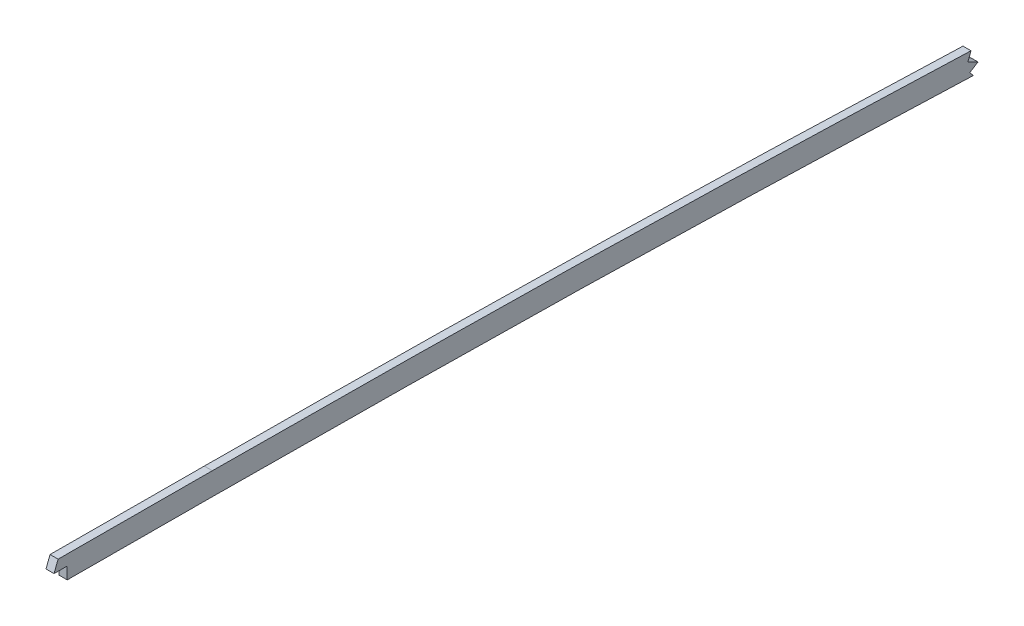
ISO-10303-21;
HEADER;
FILE_DESCRIPTION(('STEP AP214'),'2;1');
FILE_NAME('part.step','',(''),(''),'','','');
FILE_SCHEMA(('AUTOMOTIVE_DESIGN { 1 0 10303 214 1 1 1 1 }'));
ENDSEC;
DATA;
#1=APPLICATION_CONTEXT('core data for automotive mechanical design processes');
#2=APPLICATION_PROTOCOL_DEFINITION('international standard','automotive_design',2000,#1);
#3=PRODUCT_CONTEXT('',#1,'mechanical');
#4=PRODUCT('Part','Part','',(#3));
#5=PRODUCT_RELATED_PRODUCT_CATEGORY('part','',(#4));
#6=PRODUCT_DEFINITION_FORMATION('','',#4);
#7=PRODUCT_DEFINITION_CONTEXT('part definition',#1,'design');
#8=PRODUCT_DEFINITION('design','',#6,#7);
#9=PRODUCT_DEFINITION_SHAPE('','',#8);
#10=(LENGTH_UNIT() NAMED_UNIT(*) SI_UNIT(.MILLI.,.METRE.));
#11=(NAMED_UNIT(*) PLANE_ANGLE_UNIT() SI_UNIT($,.RADIAN.));
#12=(NAMED_UNIT(*) SI_UNIT($,.STERADIAN.) SOLID_ANGLE_UNIT());
#13=UNCERTAINTY_MEASURE_WITH_UNIT(LENGTH_MEASURE(1.E-05),#10,'distance_accuracy_value','');
#14=(GEOMETRIC_REPRESENTATION_CONTEXT(3) GLOBAL_UNCERTAINTY_ASSIGNED_CONTEXT((#13)) GLOBAL_UNIT_ASSIGNED_CONTEXT((#10,
#11,#12)) REPRESENTATION_CONTEXT('',''));
#15=CARTESIAN_POINT('',(0.,0.,0.));
#16=DIRECTION('',(0.,0.,1.));
#17=DIRECTION('',(1.,0.,0.));
#18=AXIS2_PLACEMENT_3D('',#15,#16,#17);
#19=CARTESIAN_POINT('',(-1.5875,130.065080520532,-1227.57650683661));
#20=CARTESIAN_POINT('',(-1.5875,129.853195249361,-1269.91120577335));
#21=CARTESIAN_POINT('',(-1.5875,129.273373321292,-1333.42774670073));
#22=CARTESIAN_POINT('',(-1.5875,127.449050562726,-1418.04220816145));
#23=CARTESIAN_POINT('',(-1.5875,124.913583681604,-1502.66599483243));
#24=CARTESIAN_POINT('',(-1.5875,120.803299478751,-1608.45417698691));
#25=CARTESIAN_POINT('',(-1.5875,116.848243244922,-1693.07007333091));
#26=CARTESIAN_POINT('',(-1.5875,114.744712178998,-1735.36978773271));
#27=B_SPLINE_CURVE_WITH_KNOTS('',3,(#19,#20,#21,#22,#23,#24,#25,#26),.UNSPECIFIED.,.F.,.F.,(4,1,
1,1,1,4),(0.,0.25,0.375,0.5,0.75,1.),.UNSPECIFIED.);
#28=DIRECTION('',(1.,0.,0.));
#29=VECTOR('',#28,1.);
#30=SURFACE_OF_LINEAR_EXTRUSION('',#27,#29);
#31=DIRECTION('',(1.,0.,0.));
#32=VECTOR('',#31,1.);
#33=CARTESIAN_POINT('',(-1.5875,123.861846153961,-1527.87468695882));
#34=LINE('',#33,#32);
#35=CARTESIAN_POINT('',(1.5875,123.86184615396,-1527.87468695882));
#36=VERTEX_POINT('',#35);
#37=CARTESIAN_POINT('',(-1.5875,123.861846153961,-1527.87468695882));
#38=VERTEX_POINT('',#37);
#39=EDGE_CURVE('E341',#36,#38,#34,.F.);
#40=ORIENTED_EDGE('',*,*,#39,.F.);
#41=CARTESIAN_POINT('',(1.5875,130.065080520532,-1227.57650683661));
#42=CARTESIAN_POINT('',(1.5875,129.853195249361,-1269.91120577335));
#43=CARTESIAN_POINT('',(1.5875,129.273373321292,-1333.42774670073));
#44=CARTESIAN_POINT('',(1.5875,127.449050562726,-1418.04220816145));
#45=CARTESIAN_POINT('',(1.5875,124.913583681604,-1502.66599483243));
#46=CARTESIAN_POINT('',(1.5875,120.803299478751,-1608.45417698691));
#47=CARTESIAN_POINT('',(1.5875,116.848243244922,-1693.07007333091));
#48=CARTESIAN_POINT('',(1.5875,114.744712178998,-1735.36978773271));
#49=B_SPLINE_CURVE_WITH_KNOTS('',3,(#41,#42,#43,#44,#45,#46,#47,#48),.UNSPECIFIED.,.F.,.F.,(4,1,
1,1,1,4),(0.,0.25,0.375,0.5,0.75,1.),.UNSPECIFIED.);
#50=CARTESIAN_POINT('',(1.5875,130.065080520201,-1227.57650690267));
#51=VERTEX_POINT('',#50);
#52=EDGE_CURVE('E169',#51,#36,#49,.T.);
#53=ORIENTED_EDGE('',*,*,#52,.F.);
#54=DIRECTION('',(1.,0.,0.));
#55=VECTOR('',#54,1.);
#56=CARTESIAN_POINT('',(-1.5875,130.065080520201,-1227.57650690267));
#57=LINE('',#56,#55);
#58=CARTESIAN_POINT('',(-1.5875,130.065080520201,-1227.57650690267));
#59=VERTEX_POINT('',#58);
#60=EDGE_CURVE('E51',#59,#51,#57,.T.);
#61=ORIENTED_EDGE('',*,*,#60,.F.);
#62=EDGE_CURVE('E173',#59,#38,#27,.T.);
#63=ORIENTED_EDGE('',*,*,#62,.T.);
#64=EDGE_LOOP('',(#40,#53,#61,#63));
#65=FACE_BOUND('',#64,.T.);
#66=ADVANCED_FACE('F40',(#65),#30,.T.);
#67=CARTESIAN_POINT('',(-1.5875,130.384545774155,-1110.40497092626));
#68=CARTESIAN_POINT('',(-1.5875,130.370061323144,-1120.17083446494));
#69=CARTESIAN_POINT('',(-1.5875,130.338772026178,-1139.70305790845));
#70=CARTESIAN_POINT('',(-1.5875,130.277673039036,-1168.9983709745));
#71=CARTESIAN_POINT('',(-1.5875,130.194386875825,-1198.29061039493));
#72=CARTESIAN_POINT('',(-1.5875,130.113940835821,-1217.81419633032));
#73=CARTESIAN_POINT('',(-1.5875,130.065080520201,-1227.57650690267));
#74=B_SPLINE_CURVE_WITH_KNOTS('',3,(#67,#68,#69,#70,#71,#72,#73),.UNSPECIFIED.,.F.,.F.,(4,1,1,1,
4),(0.,0.25,0.5,0.75,1.),.UNSPECIFIED.);
#75=DIRECTION('',(1.,0.,0.));
#76=VECTOR('',#75,1.);
#77=SURFACE_OF_LINEAR_EXTRUSION('',#74,#76);
#78=DIRECTION('',(1.,0.,0.));
#79=VECTOR('',#78,1.);
#80=CARTESIAN_POINT('',(-1.5875,130.270526743321,-1170.38690422889));
#81=LINE('',#80,#79);
#82=CARTESIAN_POINT('',(-1.5875,130.270526743297,-1170.38690422889));
#83=VERTEX_POINT('',#82);
#84=CARTESIAN_POINT('',(1.5875,130.270526743297,-1170.38690423865));
#85=VERTEX_POINT('',#84);
#86=EDGE_CURVE('E58',#83,#85,#81,.T.);
#87=ORIENTED_EDGE('',*,*,#86,.F.);
#88=EDGE_CURVE('E282',#83,#59,#74,.T.);
#89=ORIENTED_EDGE('',*,*,#88,.T.);
#90=ORIENTED_EDGE('',*,*,#60,.T.);
#91=CARTESIAN_POINT('',(1.5875,130.384545774155,-1110.40497092626));
#92=CARTESIAN_POINT('',(1.5875,130.370061323144,-1120.17083446494));
#93=CARTESIAN_POINT('',(1.5875,130.338772026178,-1139.70305790845));
#94=CARTESIAN_POINT('',(1.5875,130.277673039036,-1168.9983709745));
#95=CARTESIAN_POINT('',(1.5875,130.194386875825,-1198.29061039493));
#96=CARTESIAN_POINT('',(1.5875,130.113940835821,-1217.81419633032));
#97=CARTESIAN_POINT('',(1.5875,130.065080520201,-1227.57650690267));
#98=B_SPLINE_CURVE_WITH_KNOTS('',3,(#91,#92,#93,#94,#95,#96,#97),.UNSPECIFIED.,.F.,.F.,(4,1,1,1,
4),(0.,0.25,0.5,0.75,1.),.UNSPECIFIED.);
#99=EDGE_CURVE('E181',#85,#51,#98,.T.);
#100=ORIENTED_EDGE('',*,*,#99,.F.);
#101=EDGE_LOOP('',(#87,#89,#90,#100));
#102=FACE_BOUND('',#101,.T.);
#103=ADVANCED_FACE('F241',(#102),#77,.T.);
#104=CARTESIAN_POINT('',(-1.5875,139.27453599607,-1110.41815630688));
#105=CARTESIAN_POINT('',(-1.5875,139.245563914327,-1129.95202724936));
#106=CARTESIAN_POINT('',(-1.5875,139.211997476426,-1149.4858935041));
#107=CARTESIAN_POINT('',(-1.5875,139.115899086841,-1188.55355889258));
#108=CARTESIAN_POINT('',(-1.5875,139.052735015377,-1208.0873468335));
#109=CARTESIAN_POINT('',(-1.5875,138.954969175154,-1227.62100075096));
#110=B_SPLINE_CURVE_WITH_KNOTS('',3,(#104,#105,#106,#107,#108,#109),.UNSPECIFIED.,.F.,.F.,(4,2,
4),(0.,0.5,1.),.UNSPECIFIED.);
#111=DIRECTION('',(1.,0.,0.));
#112=VECTOR('',#111,1.);
#113=SURFACE_OF_LINEAR_EXTRUSION('',#110,#112);
#114=CARTESIAN_POINT('',(-1.5875,138.954969175154,-1227.62100075096));
#115=CARTESIAN_POINT('',(-1.5875,139.052735015377,-1208.0873468335));
#116=CARTESIAN_POINT('',(-1.5875,139.115899086841,-1188.55355889258));
#117=CARTESIAN_POINT('',(-1.5875,139.165793578878,-1168.26954239614));
#118=CARTESIAN_POINT('',(-1.5875,139.167617515609,-1167.51935854445));
#119=CARTESIAN_POINT('',(-1.5875,139.169420651929,-1166.7691746449));
#120=B_SPLINE_CURVE_WITH_KNOTS('',3,(#114,#115,#116,#117,#118,#119),.UNSPECIFIED.,.F.,.F.,(4,2,
4),(0.480797833842073,0.980797833842073,1.),.UNSPECIFIED.);
#121=CARTESIAN_POINT('',(-1.5875,139.169420645132,-1166.76917747251));
#122=VERTEX_POINT('',#121);
#123=CARTESIAN_POINT('',(-1.5875,138.954969175154,-1227.62100075096));
#124=VERTEX_POINT('',#123);
#125=EDGE_CURVE('E260',#122,#124,#120,.F.);
#126=ORIENTED_EDGE('',*,*,#125,.F.);
#127=DIRECTION('',(1.,0.,0.));
#128=VECTOR('',#127,1.);
#129=CARTESIAN_POINT('',(-6.0325,139.169420645132,-1166.76917747251));
#130=LINE('',#129,#128);
#131=CARTESIAN_POINT('',(1.5875,139.169420645132,-1166.76917747251));
#132=VERTEX_POINT('',#131);
#133=EDGE_CURVE('E158',#122,#132,#130,.T.);
#134=ORIENTED_EDGE('',*,*,#133,.T.);
#135=CARTESIAN_POINT('',(1.5875,139.169420651877,-1166.76917466631));
#136=CARTESIAN_POINT('',(1.5875,139.167617515574,-1167.51935855872));
#137=CARTESIAN_POINT('',(1.5875,139.16579357886,-1168.26954240328));
#138=CARTESIAN_POINT('',(1.5875,139.115899086841,-1188.55355889258));
#139=CARTESIAN_POINT('',(1.5875,139.052735015377,-1208.0873468335));
#140=CARTESIAN_POINT('',(1.5875,138.954969175154,-1227.62100075096));
#141=B_SPLINE_CURVE_WITH_KNOTS('',3,(#135,#136,#137,#138,#139,#140),.UNSPECIFIED.,.F.,.F.,(4,2,
4),(0.480797834024699,0.5,1.),.UNSPECIFIED.);
#142=CARTESIAN_POINT('',(1.5875,138.954969175154,-1227.62100075096));
#143=VERTEX_POINT('',#142);
#144=EDGE_CURVE('E257',#132,#143,#141,.T.);
#145=ORIENTED_EDGE('',*,*,#144,.T.);
#146=DIRECTION('',(1.,0.,0.));
#147=VECTOR('',#146,1.);
#148=CARTESIAN_POINT('',(-1.5875,138.954969175154,-1227.62100075096));
#149=LINE('',#148,#147);
#150=EDGE_CURVE('E274',#124,#143,#149,.T.);
#151=ORIENTED_EDGE('',*,*,#150,.F.);
#152=EDGE_LOOP('',(#126,#134,#145,#151));
#153=FACE_BOUND('',#152,.T.);
#154=ADVANCED_FACE('F201',(#153),#113,.F.);
#155=CARTESIAN_POINT('',(-1.5875,138.954969175154,-1227.62100075096));
#156=CARTESIAN_POINT('',(-1.5875,138.848931677458,-1248.80730367889));
#157=CARTESIAN_POINT('',(-1.5875,138.701170252211,-1269.99358315547));
#158=CARTESIAN_POINT('',(-1.5875,138.270664618355,-1312.36383234785));
#159=CARTESIAN_POINT('',(-1.5875,137.987407831877,-1333.54771900803));
#160=CARTESIAN_POINT('',(-1.5875,137.249274812871,-1375.91236818886));
#161=CARTESIAN_POINT('',(-1.5875,136.792567699979,-1397.09309738037));
#162=CARTESIAN_POINT('',(-1.5875,135.701855834805,-1439.4513282587));
#163=CARTESIAN_POINT('',(-1.5875,135.069210583559,-1460.62901031184));
#164=CARTESIAN_POINT('',(-1.5875,133.670541384634,-1502.97910116089));
#165=CARTESIAN_POINT('',(-1.5875,132.907434339273,-1524.1521527359));
#166=CARTESIAN_POINT('',(-1.5875,131.284732459282,-1566.49430375863));
#167=CARTESIAN_POINT('',(-1.5875,130.423163385131,-1587.66316602409));
#168=CARTESIAN_POINT('',(-1.5875,127.709123982652,-1651.16405280942));
#169=CARTESIAN_POINT('',(-1.5875,125.728325331464,-1693.49042156091));
#170=CARTESIAN_POINT('',(-1.5875,123.62374006878,-1735.81133470922));
#171=B_SPLINE_CURVE_WITH_KNOTS('',3,(#155,#156,#157,#158,#159,#160,#161,#162,#163,#164,#165,
#166,#167,#168,#169,#170),.UNSPECIFIED.,.F.,.F.,(4,2,2,2,2,2,2,4),(0.,0.125,0.25,0.375,
0.500000000000001,0.625000000000001,0.750000000000001,1.),.UNSPECIFIED.);
#172=DIRECTION('',(1.,0.,0.));
#173=VECTOR('',#172,1.);
#174=SURFACE_OF_LINEAR_EXTRUSION('',#171,#173);
#175=CARTESIAN_POINT('',(1.5875,138.954969175154,-1227.62100075096));
#176=CARTESIAN_POINT('',(1.5875,138.848931677458,-1248.80730367889));
#177=CARTESIAN_POINT('',(1.5875,138.701170252211,-1269.99358315547));
#178=CARTESIAN_POINT('',(1.5875,138.270664618355,-1312.36383234785));
#179=CARTESIAN_POINT('',(1.5875,137.987407831877,-1333.54771900803));
#180=CARTESIAN_POINT('',(1.5875,137.249274812871,-1375.91236818886));
#181=CARTESIAN_POINT('',(1.5875,136.792567699979,-1397.09309738037));
#182=CARTESIAN_POINT('',(1.5875,135.701855834805,-1439.4513282587));
#183=CARTESIAN_POINT('',(1.5875,135.069210583559,-1460.62901031184));
#184=CARTESIAN_POINT('',(1.5875,133.873160168888,-1496.84403796835));
#185=CARTESIAN_POINT('',(1.5875,133.344272282631,-1511.88301433852));
#186=CARTESIAN_POINT('',(1.5875,132.788776488503,-1526.92099121988));
#187=B_SPLINE_CURVE_WITH_KNOTS('',3,(#175,#176,#177,#178,#179,#180,#181,#182,#183,#184,#185,
#186),.UNSPECIFIED.,.F.,.F.,(4,2,2,2,2,4),(0.,0.125,0.25,0.375,0.500000000000001,
0.588783647983153),.UNSPECIFIED.);
#188=CARTESIAN_POINT('',(1.5875,132.788739799749,-1526.92098986479));
#189=VERTEX_POINT('',#188);
#190=EDGE_CURVE('E223',#143,#189,#187,.T.);
#191=ORIENTED_EDGE('',*,*,#190,.T.);
#192=DIRECTION('',(1.,0.,0.));
#193=VECTOR('',#192,1.);
#194=CARTESIAN_POINT('',(-6.0325,132.788776066568,-1526.92100264218));
#195=LINE('',#194,#193);
#196=CARTESIAN_POINT('',(-1.5875,132.788739575143,-1526.92098978566));
#197=VERTEX_POINT('',#196);
#198=EDGE_CURVE('E66',#197,#189,#195,.T.);
#199=ORIENTED_EDGE('',*,*,#198,.F.);
#200=CARTESIAN_POINT('',(-1.5875,132.788776491109,-1526.92099114932));
#201=CARTESIAN_POINT('',(-1.5875,133.344272284285,-1511.88301429148));
#202=CARTESIAN_POINT('',(-1.5875,133.873160169665,-1496.84403794483));
#203=CARTESIAN_POINT('',(-1.5875,135.069210583559,-1460.62901031184));
#204=CARTESIAN_POINT('',(-1.5875,135.701855834805,-1439.4513282587));
#205=CARTESIAN_POINT('',(-1.5875,136.792567699979,-1397.09309738037));
#206=CARTESIAN_POINT('',(-1.5875,137.249274812871,-1375.91236818886));
#207=CARTESIAN_POINT('',(-1.5875,137.987407831877,-1333.54771900803));
#208=CARTESIAN_POINT('',(-1.5875,138.270664618355,-1312.36383234785));
#209=CARTESIAN_POINT('',(-1.5875,138.701170252211,-1269.99358315547));
#210=CARTESIAN_POINT('',(-1.5875,138.848931677458,-1248.80730367889));
#211=CARTESIAN_POINT('',(-1.5875,138.954969175154,-1227.62100075096));
#212=B_SPLINE_CURVE_WITH_KNOTS('',3,(#200,#201,#202,#203,#204,#205,#206,#207,#208,#209,#210,
#211),.UNSPECIFIED.,.F.,.F.,(4,2,2,2,2,4),(0.,0.0887836478442923,0.213783647844292,
0.338783647844293,0.463783647844293,0.588783647844293),.UNSPECIFIED.);
#213=EDGE_CURVE('E180',#124,#197,#212,.F.);
#214=ORIENTED_EDGE('',*,*,#213,.F.);
#215=ORIENTED_EDGE('',*,*,#150,.T.);
#216=EDGE_LOOP('',(#191,#199,#214,#215));
#217=FACE_BOUND('',#216,.T.);
#218=ADVANCED_FACE('F196',(#217),#174,.F.);
#219=CARTESIAN_POINT('',(-1.5875,0.,0.));
#220=DIRECTION('',(1.,0.,0.));
#221=DIRECTION('',(0.,0.,-1.));
#222=AXIS2_PLACEMENT_3D('',#219,#220,#221);
#223=PLANE('',#222);
#224=DIRECTION('',(0.,0.,1.));
#225=VECTOR('',#224,1.);
#226=CARTESIAN_POINT('',(-1.5875,135.018963115095,0.));
#227=LINE('',#226,#225);
#228=CARTESIAN_POINT('',(-1.5875,135.018963115095,-1170.38690422889));
#229=VERTEX_POINT('',#228);
#230=CARTESIAN_POINT('',(-1.5875,135.018963115095,-1165.18665663751));
#231=VERTEX_POINT('',#230);
#232=EDGE_CURVE('E135',#229,#231,#227,.T.);
#233=ORIENTED_EDGE('',*,*,#232,.T.);
#234=DIRECTION('',(0.,0.934383280757223,-0.35626939896849));
#235=VECTOR('',#234,1.);
#236=CARTESIAN_POINT('',(-1.5875,-370.74384302385,-972.345223497019));
#237=LINE('',#236,#235);
#238=EDGE_CURVE('E165',#231,#122,#237,.T.);
#239=ORIENTED_EDGE('',*,*,#238,.T.);
#240=ORIENTED_EDGE('',*,*,#125,.T.);
#241=ORIENTED_EDGE('',*,*,#213,.T.);
#242=DIRECTION('',(0.,-0.931582630936131,0.363529643547972));
#243=VECTOR('',#242,1.);
#244=CARTESIAN_POINT('',(-1.5875,-499.555321322261,-1280.1626189093));
#245=LINE('',#244,#243);
#246=CARTESIAN_POINT('',(-1.5875,129.632745347889,-1525.68943103051));
#247=VERTEX_POINT('',#246);
#248=EDGE_CURVE('E163',#197,#247,#245,.T.);
#249=ORIENTED_EDGE('',*,*,#248,.T.);
#250=DIRECTION('',(0.,-0.458923809256453,-0.888475625606886));
#251=VECTOR('',#250,1.);
#252=CARTESIAN_POINT('',(-1.5875,724.419258768723,-374.183867459269));
#253=LINE('',#252,#251);
#254=CARTESIAN_POINT('',(-1.5875,127.575945218119,-1529.67139218656));
#255=VERTEX_POINT('',#254);
#256=EDGE_CURVE('E323',#247,#255,#253,.T.);
#257=ORIENTED_EDGE('',*,*,#256,.T.);
#258=DIRECTION('',(0.,-0.52709506372406,0.84980632722858));
#259=VECTOR('',#258,1.);
#260=CARTESIAN_POINT('',(-1.5875,-593.052127406611,-367.842458771192));
#261=LINE('',#260,#259);
#262=CARTESIAN_POINT('',(-1.5875,125.564439067124,-1526.42835165741));
#263=VERTEX_POINT('',#262);
#264=EDGE_CURVE('E328',#255,#263,#261,.T.);
#265=ORIENTED_EDGE('',*,*,#264,.T.);
#266=DIRECTION('',(0.,-0.762131167011493,-0.647422647325301));
#267=VECTOR('',#266,1.);
#268=CARTESIAN_POINT('',(-1.5875,805.802868351719,-948.572749154283));
#269=LINE('',#268,#267);
#270=EDGE_CURVE('E337',#263,#38,#269,.T.);
#271=ORIENTED_EDGE('',*,*,#270,.T.);
#272=ORIENTED_EDGE('',*,*,#62,.F.);
#273=ORIENTED_EDGE('',*,*,#88,.F.);
#274=DIRECTION('',(0.,1.,0.));
#275=VECTOR('',#274,1.);
#276=CARTESIAN_POINT('',(-1.5875,5.4729194499419E-11,-1170.3869042289));
#277=LINE('',#276,#275);
#278=EDGE_CURVE('E344',#83,#229,#277,.T.);
#279=ORIENTED_EDGE('',*,*,#278,.T.);
#280=EDGE_LOOP('',(#233,#239,#240,#241,#249,#257,#265,#271,#272,#273,#279));
#281=FACE_BOUND('',#280,.T.);
#282=ADVANCED_FACE('F200',(#281),#223,.F.);
#283=CARTESIAN_POINT('',(1.5875,0.,0.));
#284=DIRECTION('',(1.,0.,0.));
#285=DIRECTION('',(0.,0.,-1.));
#286=AXIS2_PLACEMENT_3D('',#283,#284,#285);
#287=PLANE('',#286);
#288=DIRECTION('',(0.,0.934383280757223,-0.35626939896849));
#289=VECTOR('',#288,1.);
#290=CARTESIAN_POINT('',(1.5875,139.169420645132,-1166.76917747251));
#291=LINE('',#290,#289);
#292=CARTESIAN_POINT('',(1.5875,135.018963115095,-1165.18665663751));
#293=VERTEX_POINT('',#292);
#294=EDGE_CURVE('E139',#293,#132,#291,.T.);
#295=ORIENTED_EDGE('',*,*,#294,.F.);
#296=DIRECTION('',(0.,0.,1.));
#297=VECTOR('',#296,1.);
#298=CARTESIAN_POINT('',(1.5875,135.018963115095,-1165.18665663751));
#299=LINE('',#298,#297);
#300=CARTESIAN_POINT('',(1.5875,135.018963115095,-1170.38690422889));
#301=VERTEX_POINT('',#300);
#302=EDGE_CURVE('E132',#301,#293,#299,.T.);
#303=ORIENTED_EDGE('',*,*,#302,.F.);
#304=DIRECTION('',(0.,1.,0.));
#305=VECTOR('',#304,1.);
#306=CARTESIAN_POINT('',(1.5875,5.4729194499419E-11,-1170.3869042289));
#307=LINE('',#306,#305);
#308=EDGE_CURVE('E11',#85,#301,#307,.T.);
#309=ORIENTED_EDGE('',*,*,#308,.F.);
#310=ORIENTED_EDGE('',*,*,#99,.T.);
#311=ORIENTED_EDGE('',*,*,#52,.T.);
#312=DIRECTION('',(0.,-0.762131167011493,-0.647422647325301));
#313=VECTOR('',#312,1.);
#314=CARTESIAN_POINT('',(1.5875,125.564439067124,-1526.42835165741));
#315=LINE('',#314,#313);
#316=CARTESIAN_POINT('',(1.5875,125.564439067124,-1526.42835165741));
#317=VERTEX_POINT('',#316);
#318=EDGE_CURVE('E317',#317,#36,#315,.T.);
#319=ORIENTED_EDGE('',*,*,#318,.F.);
#320=DIRECTION('',(0.,-0.52709506372406,0.84980632722858));
#321=VECTOR('',#320,1.);
#322=CARTESIAN_POINT('',(1.5875,127.575945218119,-1529.67139218656));
#323=LINE('',#322,#321);
#324=CARTESIAN_POINT('',(1.5875,127.575945218119,-1529.67139218656));
#325=VERTEX_POINT('',#324);
#326=EDGE_CURVE('E356',#325,#317,#323,.T.);
#327=ORIENTED_EDGE('',*,*,#326,.F.);
#328=DIRECTION('',(0.,-0.458923809256453,-0.888475625606886));
#329=VECTOR('',#328,1.);
#330=CARTESIAN_POINT('',(1.5875,129.632745347889,-1525.68943103051));
#331=LINE('',#330,#329);
#332=CARTESIAN_POINT('',(1.5875,129.632745347889,-1525.68943103051));
#333=VERTEX_POINT('',#332);
#334=EDGE_CURVE('E361',#333,#325,#331,.T.);
#335=ORIENTED_EDGE('',*,*,#334,.F.);
#336=DIRECTION('',(0.,-0.931582630936132,0.363529643547972));
#337=VECTOR('',#336,1.);
#338=CARTESIAN_POINT('',(1.5875,132.788776066568,-1526.92100264218));
#339=LINE('',#338,#337);
#340=EDGE_CURVE('E370',#189,#333,#339,.T.);
#341=ORIENTED_EDGE('',*,*,#340,.F.);
#342=ORIENTED_EDGE('',*,*,#190,.F.);
#343=ORIENTED_EDGE('',*,*,#144,.F.);
#344=EDGE_LOOP('',(#295,#303,#309,#310,#311,#319,#327,#335,#341,#342,#343));
#345=FACE_BOUND('',#344,.T.);
#346=ADVANCED_FACE('F144',(#345),#287,.T.);
#347=CARTESIAN_POINT('',(-6.0325,127.575945218119,-1529.67139218656));
#348=DIRECTION('',(0.,0.84980632722858,0.52709506372406));
#349=DIRECTION('',(0.,-0.52709506372406,0.84980632722858));
#350=AXIS2_PLACEMENT_3D('',#347,#348,#349);
#351=PLANE('',#350);
#352=DIRECTION('',(1.,0.,0.));
#353=VECTOR('',#352,1.);
#354=CARTESIAN_POINT('',(-6.0325,127.575945218119,-1529.67139218656));
#355=LINE('',#354,#353);
#356=EDGE_CURVE('E152',#255,#325,#355,.T.);
#357=ORIENTED_EDGE('',*,*,#356,.T.);
#358=ORIENTED_EDGE('',*,*,#326,.T.);
#359=DIRECTION('',(1.,0.,0.));
#360=VECTOR('',#359,1.);
#361=CARTESIAN_POINT('',(-6.0325,125.564439067124,-1526.42835165741));
#362=LINE('',#361,#360);
#363=EDGE_CURVE('E147',#263,#317,#362,.T.);
#364=ORIENTED_EDGE('',*,*,#363,.F.);
#365=ORIENTED_EDGE('',*,*,#264,.F.);
#366=EDGE_LOOP('',(#357,#358,#364,#365));
#367=FACE_BOUND('',#366,.T.);
#368=ADVANCED_FACE('F238',(#367),#351,.F.);
#369=CARTESIAN_POINT('',(-6.0325,129.632745347889,-1525.68943103051));
#370=DIRECTION('',(0.,-0.888475625606886,0.458923809256453));
#371=DIRECTION('',(0.,-0.458923809256453,-0.888475625606886));
#372=AXIS2_PLACEMENT_3D('',#369,#370,#371);
#373=PLANE('',#372);
#374=DIRECTION('',(1.,0.,0.));
#375=VECTOR('',#374,1.);
#376=CARTESIAN_POINT('',(-6.0325,129.632745347889,-1525.68943103051));
#377=LINE('',#376,#375);
#378=EDGE_CURVE('E316',#247,#333,#377,.T.);
#379=ORIENTED_EDGE('',*,*,#378,.T.);
#380=ORIENTED_EDGE('',*,*,#334,.T.);
#381=ORIENTED_EDGE('',*,*,#356,.F.);
#382=ORIENTED_EDGE('',*,*,#256,.F.);
#383=EDGE_LOOP('',(#379,#380,#381,#382));
#384=FACE_BOUND('',#383,.T.);
#385=ADVANCED_FACE('F377',(#384),#373,.F.);
#386=CARTESIAN_POINT('',(-6.0325,132.788776066568,-1526.92100264218));
#387=DIRECTION('',(0.,0.363529643547972,0.931582630936131));
#388=DIRECTION('',(0.,-0.931582630936131,0.363529643547972));
#389=AXIS2_PLACEMENT_3D('',#386,#387,#388);
#390=PLANE('',#389);
#391=ORIENTED_EDGE('',*,*,#198,.T.);
#392=ORIENTED_EDGE('',*,*,#340,.T.);
#393=ORIENTED_EDGE('',*,*,#378,.F.);
#394=ORIENTED_EDGE('',*,*,#248,.F.);
#395=EDGE_LOOP('',(#391,#392,#393,#394));
#396=FACE_BOUND('',#395,.T.);
#397=ADVANCED_FACE('F378',(#396),#390,.F.);
#398=CARTESIAN_POINT('',(-6.0325,125.564439067124,-1526.42835165741));
#399=DIRECTION('',(0.,-0.6474226473253,0.762131167011493));
#400=DIRECTION('',(0.,-0.762131167011493,-0.647422647325301));
#401=AXIS2_PLACEMENT_3D('',#398,#399,#400);
#402=PLANE('',#401);
#403=ORIENTED_EDGE('',*,*,#39,.T.);
#404=ORIENTED_EDGE('',*,*,#270,.F.);
#405=ORIENTED_EDGE('',*,*,#363,.T.);
#406=ORIENTED_EDGE('',*,*,#318,.T.);
#407=EDGE_LOOP('',(#403,#404,#405,#406));
#408=FACE_BOUND('',#407,.T.);
#409=ADVANCED_FACE('F380',(#408),#402,.F.);
#410=CARTESIAN_POINT('',(-6.0325,139.169420645132,-1166.76917747251));
#411=DIRECTION('',(0.,-0.35626939896849,-0.934383280757223));
#412=DIRECTION('',(0.,0.934383280757223,-0.35626939896849));
#413=AXIS2_PLACEMENT_3D('',#410,#411,#412);
#414=PLANE('',#413);
#415=DIRECTION('',(1.,0.,0.));
#416=VECTOR('',#415,1.);
#417=CARTESIAN_POINT('',(-6.0325,135.018963115095,-1165.18665663751));
#418=LINE('',#417,#416);
#419=EDGE_CURVE('E138',#231,#293,#418,.T.);
#420=ORIENTED_EDGE('',*,*,#419,.T.);
#421=ORIENTED_EDGE('',*,*,#294,.T.);
#422=ORIENTED_EDGE('',*,*,#133,.F.);
#423=ORIENTED_EDGE('',*,*,#238,.F.);
#424=EDGE_LOOP('',(#420,#421,#422,#423));
#425=FACE_BOUND('',#424,.T.);
#426=ADVANCED_FACE('F385',(#425),#414,.F.);
#427=CARTESIAN_POINT('',(-6.0325,135.018963115095,-1165.18665663751));
#428=DIRECTION('',(0.,1.,0.));
#429=DIRECTION('',(0.,0.,1.));
#430=AXIS2_PLACEMENT_3D('',#427,#428,#429);
#431=PLANE('',#430);
#432=DIRECTION('',(1.,0.,0.));
#433=VECTOR('',#432,1.);
#434=CARTESIAN_POINT('',(-6.0325,135.018963115095,-1170.38690422889));
#435=LINE('',#434,#433);
#436=EDGE_CURVE('E128',#229,#301,#435,.T.);
#437=ORIENTED_EDGE('',*,*,#436,.T.);
#438=ORIENTED_EDGE('',*,*,#302,.T.);
#439=ORIENTED_EDGE('',*,*,#419,.F.);
#440=ORIENTED_EDGE('',*,*,#232,.F.);
#441=EDGE_LOOP('',(#437,#438,#439,#440));
#442=FACE_BOUND('',#441,.T.);
#443=ADVANCED_FACE('F129',(#442),#431,.F.);
#444=CARTESIAN_POINT('',(-6.0325,135.018963115095,-1170.38690422889));
#445=DIRECTION('',(0.,0.,-1.));
#446=DIRECTION('',(0.,1.,0.));
#447=AXIS2_PLACEMENT_3D('',#444,#445,#446);
#448=PLANE('',#447);
#449=ORIENTED_EDGE('',*,*,#86,.T.);
#450=ORIENTED_EDGE('',*,*,#308,.T.);
#451=ORIENTED_EDGE('',*,*,#436,.F.);
#452=ORIENTED_EDGE('',*,*,#278,.F.);
#453=EDGE_LOOP('',(#449,#450,#451,#452));
#454=FACE_BOUND('',#453,.T.);
#455=ADVANCED_FACE('F141',(#454),#448,.F.);
#456=CLOSED_SHELL('',(#66,#103,#154,#218,#282,#346,#368,#385,#397,#409,#426,#443,#455));
#457=MANIFOLD_SOLID_BREP('B2',#456);
#458=ADVANCED_BREP_SHAPE_REPRESENTATION('',(#18,#457),#14);
#459=SHAPE_DEFINITION_REPRESENTATION(#9,#458);
ENDSEC;
END-ISO-10303-21;
